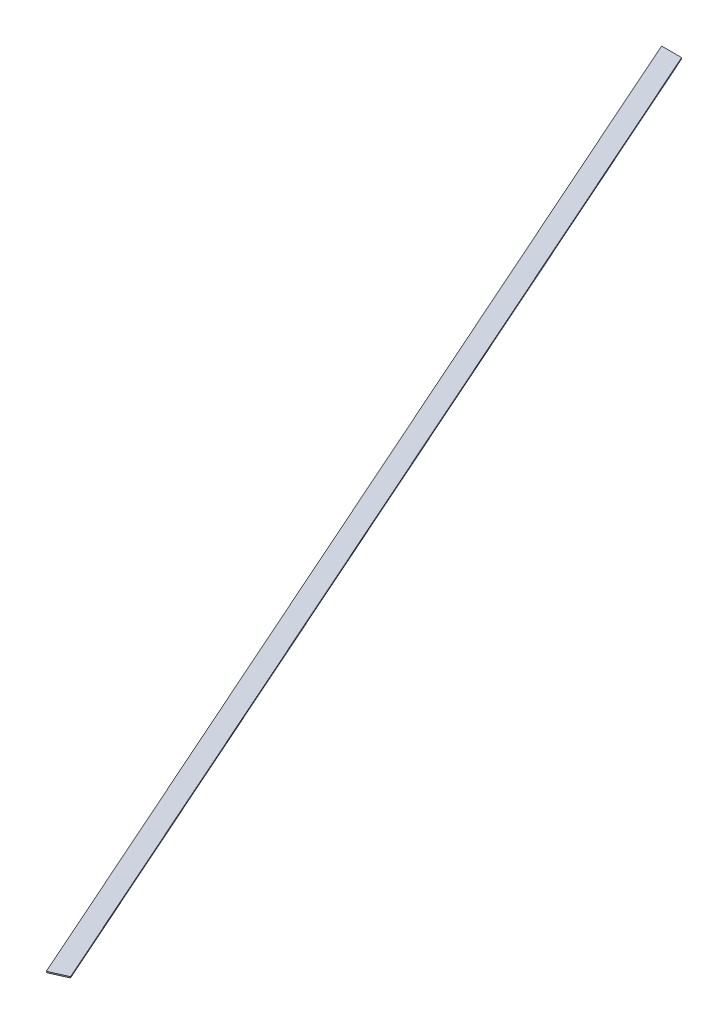
ISO-10303-21;
HEADER;
FILE_DESCRIPTION(('STEP AP214'),'2;1');
FILE_NAME('part.step','',(''),(''),'','','');
FILE_SCHEMA(('AUTOMOTIVE_DESIGN { 1 0 10303 214 1 1 1 1 }'));
ENDSEC;
DATA;
#1=APPLICATION_CONTEXT('core data for automotive mechanical design processes');
#2=APPLICATION_PROTOCOL_DEFINITION('international standard','automotive_design',2000,#1);
#3=PRODUCT_CONTEXT('',#1,'mechanical');
#4=PRODUCT('Part','Part','',(#3));
#5=PRODUCT_RELATED_PRODUCT_CATEGORY('part','',(#4));
#6=PRODUCT_DEFINITION_FORMATION('','',#4);
#7=PRODUCT_DEFINITION_CONTEXT('part definition',#1,'design');
#8=PRODUCT_DEFINITION('design','',#6,#7);
#9=PRODUCT_DEFINITION_SHAPE('','',#8);
#10=(LENGTH_UNIT() NAMED_UNIT(*) SI_UNIT(.MILLI.,.METRE.));
#11=(NAMED_UNIT(*) PLANE_ANGLE_UNIT() SI_UNIT($,.RADIAN.));
#12=(NAMED_UNIT(*) SI_UNIT($,.STERADIAN.) SOLID_ANGLE_UNIT());
#13=UNCERTAINTY_MEASURE_WITH_UNIT(LENGTH_MEASURE(1.E-05),#10,'distance_accuracy_value','');
#14=(GEOMETRIC_REPRESENTATION_CONTEXT(3) GLOBAL_UNCERTAINTY_ASSIGNED_CONTEXT((#13)) GLOBAL_UNIT_ASSIGNED_CONTEXT((#10,
#11,#12)) REPRESENTATION_CONTEXT('',''));
#15=CARTESIAN_POINT('',(0.,0.,0.));
#16=DIRECTION('',(0.,0.,1.));
#17=DIRECTION('',(1.,0.,0.));
#18=AXIS2_PLACEMENT_3D('',#15,#16,#17);
#19=CARTESIAN_POINT('',(27.8037614740545,3.175,2.45816780200209E-13));
#20=DIRECTION('',(-0.913545457642596,0.,0.406736643075811));
#21=DIRECTION('',(0.406736643075811,0.,0.913545457642596));
#22=AXIS2_PLACEMENT_3D('',#19,#20,#21);
#23=PLANE('',#22);
#24=DIRECTION('',(-0.40673664307581,0.,-0.913545457642596));
#25=VECTOR('',#24,1.);
#26=CARTESIAN_POINT('',(27.8037614740545,3.175,2.45816780200209E-13));
#27=LINE('',#26,#25);
#28=CARTESIAN_POINT('',(-444.327999075485,3.175,-1060.42529632237));
#29=VERTEX_POINT('',#28);
#30=CARTESIAN_POINT('',(-1804.22323283357,3.175,-4114.8));
#31=VERTEX_POINT('',#30);
#32=EDGE_CURVE('E87',#29,#31,#27,.T.);
#33=ORIENTED_EDGE('',*,*,#32,.F.);
#34=DIRECTION('',(0.,1.,0.));
#35=VECTOR('',#34,1.);
#36=CARTESIAN_POINT('',(-444.327999075485,0.,-1060.42529632237));
#37=LINE('',#36,#35);
#38=CARTESIAN_POINT('',(-444.327999075485,0.,-1060.42529632237));
#39=VERTEX_POINT('',#38);
#40=EDGE_CURVE('E97',#39,#29,#37,.T.);
#41=ORIENTED_EDGE('',*,*,#40,.F.);
#42=DIRECTION('',(-0.40673664307581,0.,-0.913545457642596));
#43=VECTOR('',#42,1.);
#44=CARTESIAN_POINT('',(27.8037614740545,0.,2.45816780200209E-13));
#45=LINE('',#44,#43);
#46=CARTESIAN_POINT('',(-1804.22323283357,0.,-4114.8));
#47=VERTEX_POINT('',#46);
#48=EDGE_CURVE('E78',#39,#47,#45,.T.);
#49=ORIENTED_EDGE('',*,*,#48,.T.);
#50=DIRECTION('',(0.,-1.,0.));
#51=VECTOR('',#50,1.);
#52=CARTESIAN_POINT('',(-1804.22323283357,3.175,-4114.8));
#53=LINE('',#52,#51);
#54=EDGE_CURVE('E11',#31,#47,#53,.T.);
#55=ORIENTED_EDGE('',*,*,#54,.F.);
#56=EDGE_LOOP('',(#33,#41,#49,#55));
#57=FACE_BOUND('',#56,.T.);
#58=ADVANCED_FACE('F34',(#57),#23,.F.);
#59=CARTESIAN_POINT('',(-1804.22323283357,3.175,-4114.8));
#60=DIRECTION('',(0.,0.,1.));
#61=DIRECTION('',(1.,0.,0.));
#62=AXIS2_PLACEMENT_3D('',#59,#60,#61);
#63=PLANE('',#62);
#64=DIRECTION('',(-1.,0.,0.));
#65=VECTOR('',#64,1.);
#66=CARTESIAN_POINT('',(-1804.22323283357,0.,-4114.8));
#67=LINE('',#66,#65);
#68=CARTESIAN_POINT('',(-1859.83075578167,0.,-4114.8));
#69=VERTEX_POINT('',#68);
#70=EDGE_CURVE('E69',#47,#69,#67,.T.);
#71=ORIENTED_EDGE('',*,*,#70,.T.);
#72=DIRECTION('',(0.,-1.,0.));
#73=VECTOR('',#72,1.);
#74=CARTESIAN_POINT('',(-1859.83075578167,3.175,-4114.8));
#75=LINE('',#74,#73);
#76=CARTESIAN_POINT('',(-1859.83075578167,3.175,-4114.8));
#77=VERTEX_POINT('',#76);
#78=EDGE_CURVE('E41',#77,#69,#75,.T.);
#79=ORIENTED_EDGE('',*,*,#78,.F.);
#80=DIRECTION('',(-1.,0.,0.));
#81=VECTOR('',#80,1.);
#82=CARTESIAN_POINT('',(-1804.22323283357,3.175,-4114.8));
#83=LINE('',#82,#81);
#84=EDGE_CURVE('E57',#31,#77,#83,.T.);
#85=ORIENTED_EDGE('',*,*,#84,.F.);
#86=ORIENTED_EDGE('',*,*,#54,.T.);
#87=EDGE_LOOP('',(#71,#79,#85,#86));
#88=FACE_BOUND('',#87,.T.);
#89=ADVANCED_FACE('F71',(#88),#63,.F.);
#90=CARTESIAN_POINT('',(-1859.83075578167,3.175,-4114.8));
#91=DIRECTION('',(0.913545457642596,0.,-0.40673664307581));
#92=DIRECTION('',(-0.40673664307581,0.,-0.913545457642596));
#93=AXIS2_PLACEMENT_3D('',#90,#91,#92);
#94=PLANE('',#93);
#95=DIRECTION('',(0.40673664307581,0.,0.913545457642597));
#96=VECTOR('',#95,1.);
#97=CARTESIAN_POINT('',(-1859.83075578167,0.,-4114.8));
#98=LINE('',#97,#96);
#99=CARTESIAN_POINT('',(-490.73610832373,0.,-1039.76307485412));
#100=VERTEX_POINT('',#99);
#101=EDGE_CURVE('E77',#69,#100,#98,.T.);
#102=ORIENTED_EDGE('',*,*,#101,.T.);
#103=DIRECTION('',(0.,1.,0.));
#104=VECTOR('',#103,1.);
#105=CARTESIAN_POINT('',(-490.73610832373,0.,-1039.76307485412));
#106=LINE('',#105,#104);
#107=CARTESIAN_POINT('',(-490.73610832373,3.175,-1039.76307485412));
#108=VERTEX_POINT('',#107);
#109=EDGE_CURVE('E48',#100,#108,#106,.T.);
#110=ORIENTED_EDGE('',*,*,#109,.T.);
#111=DIRECTION('',(0.40673664307581,0.,0.913545457642597));
#112=VECTOR('',#111,1.);
#113=CARTESIAN_POINT('',(-1859.83075578167,3.175,-4114.8));
#114=LINE('',#113,#112);
#115=EDGE_CURVE('E83',#77,#108,#114,.T.);
#116=ORIENTED_EDGE('',*,*,#115,.F.);
#117=ORIENTED_EDGE('',*,*,#78,.T.);
#118=EDGE_LOOP('',(#102,#110,#116,#117));
#119=FACE_BOUND('',#118,.T.);
#120=ADVANCED_FACE('F82',(#119),#94,.F.);
#121=CARTESIAN_POINT('',(0.,3.175,0.));
#122=DIRECTION('',(0.,1.,0.));
#123=DIRECTION('',(0.,0.,1.));
#124=AXIS2_PLACEMENT_3D('',#121,#122,#123);
#125=PLANE('',#124);
#126=DIRECTION('',(-0.913545457642596,0.,0.40673664307581));
#127=VECTOR('',#126,1.);
#128=CARTESIAN_POINT('',(-444.327999075485,3.175,-1060.42529632237));
#129=LINE('',#128,#127);
#130=EDGE_CURVE('E101',#29,#108,#129,.T.);
#131=ORIENTED_EDGE('',*,*,#130,.F.);
#132=ORIENTED_EDGE('',*,*,#32,.T.);
#133=ORIENTED_EDGE('',*,*,#84,.T.);
#134=ORIENTED_EDGE('',*,*,#115,.T.);
#135=EDGE_LOOP('',(#131,#132,#133,#134));
#136=FACE_BOUND('',#135,.T.);
#137=ADVANCED_FACE('F109',(#136),#125,.T.);
#138=CARTESIAN_POINT('',(0.,0.,0.));
#139=DIRECTION('',(0.,1.,0.));
#140=DIRECTION('',(0.,0.,1.));
#141=AXIS2_PLACEMENT_3D('',#138,#139,#140);
#142=PLANE('',#141);
#143=ORIENTED_EDGE('',*,*,#48,.F.);
#144=DIRECTION('',(-0.913545457642596,0.,0.40673664307581));
#145=VECTOR('',#144,1.);
#146=CARTESIAN_POINT('',(-444.327999075485,0.,-1060.42529632237));
#147=LINE('',#146,#145);
#148=EDGE_CURVE('E85',#39,#100,#147,.T.);
#149=ORIENTED_EDGE('',*,*,#148,.T.);
#150=ORIENTED_EDGE('',*,*,#101,.F.);
#151=ORIENTED_EDGE('',*,*,#70,.F.);
#152=EDGE_LOOP('',(#143,#149,#150,#151));
#153=FACE_BOUND('',#152,.T.);
#154=ADVANCED_FACE('F84',(#153),#142,.F.);
#155=CARTESIAN_POINT('',(-444.327999075485,0.,-1060.42529632237));
#156=DIRECTION('',(-0.40673664307581,0.,-0.913545457642597));
#157=DIRECTION('',(-0.913545457642597,0.,0.40673664307581));
#158=AXIS2_PLACEMENT_3D('',#155,#156,#157);
#159=PLANE('',#158);
#160=ORIENTED_EDGE('',*,*,#130,.T.);
#161=ORIENTED_EDGE('',*,*,#109,.F.);
#162=ORIENTED_EDGE('',*,*,#148,.F.);
#163=ORIENTED_EDGE('',*,*,#40,.T.);
#164=EDGE_LOOP('',(#160,#161,#162,#163));
#165=FACE_BOUND('',#164,.T.);
#166=ADVANCED_FACE('F105',(#165),#159,.F.);
#167=CLOSED_SHELL('',(#58,#89,#120,#137,#154,#166));
#168=MANIFOLD_SOLID_BREP('B2',#167);
#169=ADVANCED_BREP_SHAPE_REPRESENTATION('',(#18,#168),#14);
#170=SHAPE_DEFINITION_REPRESENTATION(#9,#169);
ENDSEC;
END-ISO-10303-21;
